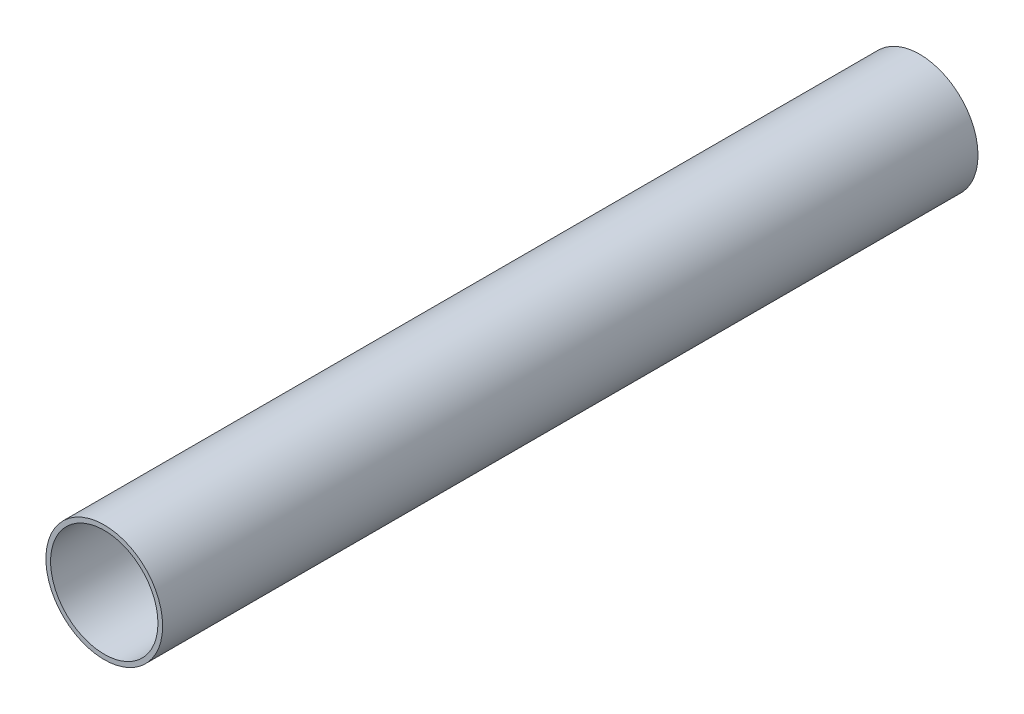
ISO-10303-21;
HEADER;
FILE_DESCRIPTION(('STEP AP214'),'2;1');
FILE_NAME('part.step','',(''),(''),'','','');
FILE_SCHEMA(('AUTOMOTIVE_DESIGN { 1 0 10303 214 1 1 1 1 }'));
ENDSEC;
DATA;
#1=APPLICATION_CONTEXT('core data for automotive mechanical design processes');
#2=APPLICATION_PROTOCOL_DEFINITION('international standard','automotive_design',2000,#1);
#3=PRODUCT_CONTEXT('',#1,'mechanical');
#4=PRODUCT('Part','Part','',(#3));
#5=PRODUCT_RELATED_PRODUCT_CATEGORY('part','',(#4));
#6=PRODUCT_DEFINITION_FORMATION('','',#4);
#7=PRODUCT_DEFINITION_CONTEXT('part definition',#1,'design');
#8=PRODUCT_DEFINITION('design','',#6,#7);
#9=PRODUCT_DEFINITION_SHAPE('','',#8);
#10=(LENGTH_UNIT() NAMED_UNIT(*) SI_UNIT(.MILLI.,.METRE.));
#11=(NAMED_UNIT(*) PLANE_ANGLE_UNIT() SI_UNIT($,.RADIAN.));
#12=(NAMED_UNIT(*) SI_UNIT($,.STERADIAN.) SOLID_ANGLE_UNIT());
#13=UNCERTAINTY_MEASURE_WITH_UNIT(LENGTH_MEASURE(1.E-05),#10,'distance_accuracy_value','');
#14=(GEOMETRIC_REPRESENTATION_CONTEXT(3) GLOBAL_UNCERTAINTY_ASSIGNED_CONTEXT((#13)) GLOBAL_UNIT_ASSIGNED_CONTEXT((#10,
#11,#12)) REPRESENTATION_CONTEXT('',''));
#15=CARTESIAN_POINT('',(0.,0.,0.));
#16=DIRECTION('',(0.,0.,1.));
#17=DIRECTION('',(1.,0.,0.));
#18=AXIS2_PLACEMENT_3D('',#15,#16,#17);
#19=CARTESIAN_POINT('',(0.,0.,349.25));
#20=DIRECTION('',(0.,0.,1.));
#21=DIRECTION('',(1.,0.,0.));
#22=AXIS2_PLACEMENT_3D('',#19,#20,#21);
#23=PLANE('',#22);
#24=CARTESIAN_POINT('',(0.,0.,349.25));
#25=DIRECTION('',(0.,0.,1.));
#26=DIRECTION('',(1.,0.,0.));
#27=AXIS2_PLACEMENT_3D('',#24,#25,#26);
#28=CIRCLE('',#27,25.);
#29=CARTESIAN_POINT('',(25.,0.,349.25));
#30=VERTEX_POINT('',#29);
#31=EDGE_CURVE('E10',#30,#30,#28,.T.);
#32=ORIENTED_EDGE('',*,*,#31,.T.);
#33=EDGE_LOOP('',(#32));
#34=FACE_BOUND('',#33,.T.);
#35=CARTESIAN_POINT('',(0.,0.,349.25));
#36=DIRECTION('',(0.,0.,1.));
#37=DIRECTION('',(1.,0.,0.));
#38=AXIS2_PLACEMENT_3D('',#35,#36,#37);
#39=CIRCLE('',#38,23.);
#40=CARTESIAN_POINT('',(23.,0.,349.25));
#41=VERTEX_POINT('',#40);
#42=EDGE_CURVE('E54',#41,#41,#39,.T.);
#43=ORIENTED_EDGE('',*,*,#42,.F.);
#44=EDGE_LOOP('',(#43));
#45=FACE_BOUND('',#44,.T.);
#46=ADVANCED_FACE('F41',(#34,#45),#23,.T.);
#47=CARTESIAN_POINT('',(0.,0.,0.));
#48=DIRECTION('',(0.,0.,1.));
#49=DIRECTION('',(1.,0.,0.));
#50=AXIS2_PLACEMENT_3D('',#47,#48,#49);
#51=PLANE('',#50);
#52=CARTESIAN_POINT('',(0.,0.,0.));
#53=DIRECTION('',(0.,0.,1.));
#54=DIRECTION('',(1.,0.,0.));
#55=AXIS2_PLACEMENT_3D('',#52,#53,#54);
#56=CIRCLE('',#55,25.);
#57=CARTESIAN_POINT('',(25.,0.,0.));
#58=VERTEX_POINT('',#57);
#59=EDGE_CURVE('E45',#58,#58,#56,.T.);
#60=ORIENTED_EDGE('',*,*,#59,.F.);
#61=EDGE_LOOP('',(#60));
#62=FACE_BOUND('',#61,.T.);
#63=CARTESIAN_POINT('',(0.,0.,0.));
#64=DIRECTION('',(0.,0.,1.));
#65=DIRECTION('',(1.,0.,0.));
#66=AXIS2_PLACEMENT_3D('',#63,#64,#65);
#67=CIRCLE('',#66,23.);
#68=CARTESIAN_POINT('',(23.,0.,0.));
#69=VERTEX_POINT('',#68);
#70=EDGE_CURVE('E56',#69,#69,#67,.T.);
#71=ORIENTED_EDGE('',*,*,#70,.T.);
#72=EDGE_LOOP('',(#71));
#73=FACE_BOUND('',#72,.T.);
#74=ADVANCED_FACE('F68',(#62,#73),#51,.F.);
#75=CARTESIAN_POINT('',(0.,0.,349.25));
#76=DIRECTION('',(0.,0.,-1.));
#77=DIRECTION('',(-1.,0.,0.));
#78=AXIS2_PLACEMENT_3D('',#75,#76,#77);
#79=CYLINDRICAL_SURFACE('',#78,25.);
#80=ORIENTED_EDGE('',*,*,#31,.F.);
#81=EDGE_LOOP('',(#80));
#82=FACE_BOUND('',#81,.T.);
#83=ORIENTED_EDGE('',*,*,#59,.T.);
#84=EDGE_LOOP('',(#83));
#85=FACE_BOUND('',#84,.T.);
#86=ADVANCED_FACE('F43',(#82,#85),#79,.T.);
#87=CARTESIAN_POINT('',(0.,0.,349.25));
#88=DIRECTION('',(0.,0.,-1.));
#89=DIRECTION('',(-1.,0.,0.));
#90=AXIS2_PLACEMENT_3D('',#87,#88,#89);
#91=CYLINDRICAL_SURFACE('',#90,23.);
#92=ORIENTED_EDGE('',*,*,#42,.T.);
#93=EDGE_LOOP('',(#92));
#94=FACE_BOUND('',#93,.T.);
#95=ORIENTED_EDGE('',*,*,#70,.F.);
#96=EDGE_LOOP('',(#95));
#97=FACE_BOUND('',#96,.T.);
#98=ADVANCED_FACE('F64',(#94,#97),#91,.F.);
#99=CLOSED_SHELL('',(#46,#74,#86,#98));
#100=MANIFOLD_SOLID_BREP('B2',#99);
#101=ADVANCED_BREP_SHAPE_REPRESENTATION('',(#18,#100),#14);
#102=SHAPE_DEFINITION_REPRESENTATION(#9,#101);
ENDSEC;
END-ISO-10303-21;
